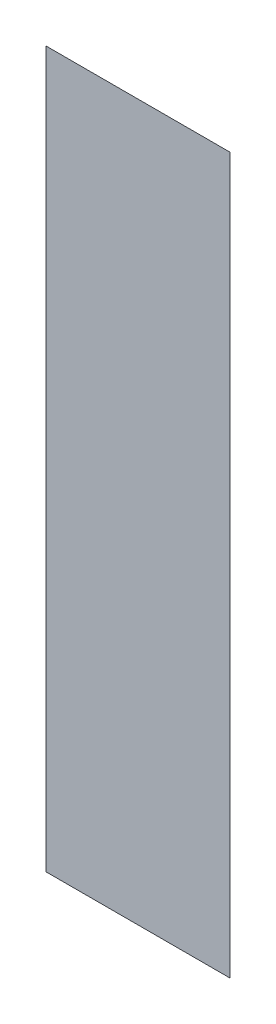
ISO-10303-21;
HEADER;
FILE_DESCRIPTION(('STEP AP214'),'2;1');
FILE_NAME('part.step','',(''),(''),'','','');
FILE_SCHEMA(('AUTOMOTIVE_DESIGN { 1 0 10303 214 1 1 1 1 }'));
ENDSEC;
DATA;
#1=APPLICATION_CONTEXT('core data for automotive mechanical design processes');
#2=APPLICATION_PROTOCOL_DEFINITION('international standard','automotive_design',2000,#1);
#3=PRODUCT_CONTEXT('',#1,'mechanical');
#4=PRODUCT('Part','Part','',(#3));
#5=PRODUCT_RELATED_PRODUCT_CATEGORY('part','',(#4));
#6=PRODUCT_DEFINITION_FORMATION('','',#4);
#7=PRODUCT_DEFINITION_CONTEXT('part definition',#1,'design');
#8=PRODUCT_DEFINITION('design','',#6,#7);
#9=PRODUCT_DEFINITION_SHAPE('','',#8);
#10=(LENGTH_UNIT() NAMED_UNIT(*) SI_UNIT(.MILLI.,.METRE.));
#11=(NAMED_UNIT(*) PLANE_ANGLE_UNIT() SI_UNIT($,.RADIAN.));
#12=(NAMED_UNIT(*) SI_UNIT($,.STERADIAN.) SOLID_ANGLE_UNIT());
#13=UNCERTAINTY_MEASURE_WITH_UNIT(LENGTH_MEASURE(1.E-05),#10,'distance_accuracy_value','');
#14=(GEOMETRIC_REPRESENTATION_CONTEXT(3) GLOBAL_UNCERTAINTY_ASSIGNED_CONTEXT((#13)) GLOBAL_UNIT_ASSIGNED_CONTEXT((#10,
#11,#12)) REPRESENTATION_CONTEXT('',''));
#15=CARTESIAN_POINT('',(0.,0.,0.));
#16=DIRECTION('',(0.,0.,1.));
#17=DIRECTION('',(1.,0.,0.));
#18=AXIS2_PLACEMENT_3D('',#15,#16,#17);
#19=CARTESIAN_POINT('',(6.50729442973,0.801856297823,0.001668));
#20=DIRECTION('',(0.,0.,1.));
#21=DIRECTION('',(1.,0.,0.));
#22=AXIS2_PLACEMENT_3D('',#19,#20,#21);
#23=PLANE('',#22);
#24=CARTESIAN_POINT('',(6.478513720937,0.913856299492,0.001668));
#25=DIRECTION('',(0.,-1.,0.));
#26=VECTOR('',#25,1.);
#27=LINE('',#24,#26);
#28=CARTESIAN_POINT('',(6.478513720937,0.913856299492,0.0015));
#29=VERTEX_POINT('',#28);
#30=CARTESIAN_POINT('',(6.478513720937,0.689856296154,0.0015));
#31=VERTEX_POINT('',#30);
#32=EDGE_CURVE('E41',#29,#31,#27,.T.);
#33=ORIENTED_EDGE('',*,*,#32,.T.);
#34=CARTESIAN_POINT('',(6.478513720937,0.689856296154,0.001668));
#35=DIRECTION('',(1.,0.,0.));
#36=VECTOR('',#35,1.);
#37=LINE('',#34,#36);
#38=CARTESIAN_POINT('',(6.536075138524,0.689856296154,0.0015));
#39=VERTEX_POINT('',#38);
#40=EDGE_CURVE('E28',#31,#39,#37,.T.);
#41=ORIENTED_EDGE('',*,*,#40,.T.);
#42=CARTESIAN_POINT('',(6.536075138524,0.689856296154,0.001668));
#43=DIRECTION('',(0.,1.,0.));
#44=VECTOR('',#43,1.);
#45=LINE('',#42,#44);
#46=CARTESIAN_POINT('',(6.536075138524,0.913856299492,0.0015));
#47=VERTEX_POINT('',#46);
#48=EDGE_CURVE('E11',#39,#47,#45,.T.);
#49=ORIENTED_EDGE('',*,*,#48,.T.);
#50=CARTESIAN_POINT('',(6.536075138524,0.913856299492,0.001668));
#51=DIRECTION('',(-1.,0.,0.));
#52=VECTOR('',#51,1.);
#53=LINE('',#50,#52);
#54=EDGE_CURVE('E44',#47,#29,#53,.T.);
#55=ORIENTED_EDGE('',*,*,#54,.T.);
#56=EDGE_LOOP('',(#33,#41,#49,#55));
#57=FACE_BOUND('',#56,.T.);
#58=ADVANCED_FACE('F17',(#57),#23,.T.);
#59=CARTESIAN_POINT('',(6.50729442973,0.801856297823,0.001332));
#60=DIRECTION('',(0.,0.,1.));
#61=DIRECTION('',(1.,0.,0.));
#62=AXIS2_PLACEMENT_3D('',#59,#60,#61);
#63=PLANE('',#62);
#64=ORIENTED_EDGE('',*,*,#40,.F.);
#65=ORIENTED_EDGE('',*,*,#32,.F.);
#66=ORIENTED_EDGE('',*,*,#54,.F.);
#67=ORIENTED_EDGE('',*,*,#48,.F.);
#68=EDGE_LOOP('',(#64,#65,#66,#67));
#69=FACE_BOUND('',#68,.T.);
#70=ADVANCED_FACE('F46',(#69),#63,.F.);
#71=CLOSED_SHELL('',(#58,#70));
#72=MANIFOLD_SOLID_BREP('B1',#71);
#73=ADVANCED_BREP_SHAPE_REPRESENTATION('',(#18,#72),#14);
#74=SHAPE_DEFINITION_REPRESENTATION(#9,#73);
ENDSEC;
END-ISO-10303-21;
